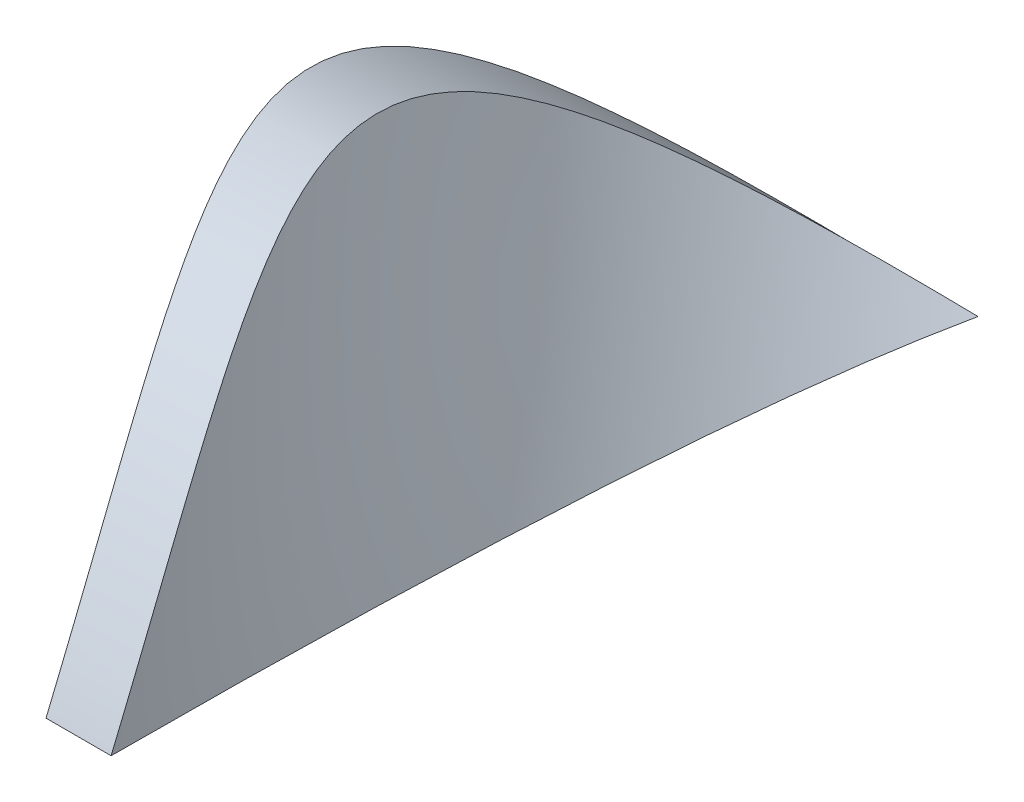
ISO-10303-21;
HEADER;
FILE_DESCRIPTION(('STEP AP214'),'2;1');
FILE_NAME('part.step','',(''),(''),'','','');
FILE_SCHEMA(('AUTOMOTIVE_DESIGN { 1 0 10303 214 1 1 1 1 }'));
ENDSEC;
DATA;
#1=APPLICATION_CONTEXT('core data for automotive mechanical design processes');
#2=APPLICATION_PROTOCOL_DEFINITION('international standard','automotive_design',2000,#1);
#3=PRODUCT_CONTEXT('',#1,'mechanical');
#4=PRODUCT('Part','Part','',(#3));
#5=PRODUCT_RELATED_PRODUCT_CATEGORY('part','',(#4));
#6=PRODUCT_DEFINITION_FORMATION('','',#4);
#7=PRODUCT_DEFINITION_CONTEXT('part definition',#1,'design');
#8=PRODUCT_DEFINITION('design','',#6,#7);
#9=PRODUCT_DEFINITION_SHAPE('','',#8);
#10=(LENGTH_UNIT() NAMED_UNIT(*) SI_UNIT(.MILLI.,.METRE.));
#11=(NAMED_UNIT(*) PLANE_ANGLE_UNIT() SI_UNIT($,.RADIAN.));
#12=(NAMED_UNIT(*) SI_UNIT($,.STERADIAN.) SOLID_ANGLE_UNIT());
#13=UNCERTAINTY_MEASURE_WITH_UNIT(LENGTH_MEASURE(1.E-05),#10,'distance_accuracy_value','');
#14=(GEOMETRIC_REPRESENTATION_CONTEXT(3) GLOBAL_UNCERTAINTY_ASSIGNED_CONTEXT((#13)) GLOBAL_UNIT_ASSIGNED_CONTEXT((#10,
#11,#12)) REPRESENTATION_CONTEXT('',''));
#15=CARTESIAN_POINT('',(0.,0.,0.));
#16=DIRECTION('',(0.,0.,1.));
#17=DIRECTION('',(1.,0.,0.));
#18=AXIS2_PLACEMENT_3D('',#15,#16,#17);
#19=CARTESIAN_POINT('',(0.499999999999999,23.,0.));
#20=CARTESIAN_POINT('',(-0.947037346833945,23.0314573336268,-3.3));
#21=CARTESIAN_POINT('',(-2.38660702132176,22.8813047470151,-6.6));
#22=CARTESIAN_POINT('',(-3.82617669580957,22.7311521604035,-9.9));
#23=CARTESIAN_POINT('',(-5.23557582422734,22.4017576495409,-13.2));
#24=CARTESIAN_POINT('',(-6.64497495264512,22.0723631386784,-16.5));
#25=CARTESIAN_POINT('',(-8.00197646880347,21.5689214517721,-19.8));
#26=CARTESIAN_POINT('',(-9.35897798496182,21.0654797648658,-23.1));
#27=CARTESIAN_POINT('',(-10.6421811643175,20.3959304780597,-26.4));
#28=CARTESIAN_POINT('',(-11.9253843436732,19.7263811912536,-29.7));
#29=CARTESIAN_POINT('',(-13.1145523055394,18.90128349677,-33.));
#30=CARTESIAN_POINT('',(-14.3037202674056,18.0761858022864,-36.3));
#31=CARTESIAN_POINT('',(-15.3800991226491,17.1085519836568,-39.6));
#32=CARTESIAN_POINT('',(-16.4564779778927,16.1409181650272,-42.9));
#33=CARTESIAN_POINT('',(-17.4030925889688,15.0460083856078,-46.2));
#34=CARTESIAN_POINT('',(-18.3497072000449,13.9510986061883,-49.5));
#35=CARTESIAN_POINT('',(-19.1516288890568,12.7461802472679,-52.8));
#36=CARTESIAN_POINT('',(-19.9535505780688,11.5412618883475,-56.1));
#37=CARTESIAN_POINT('',(-20.5981325609359,10.2453372322297,-59.4));
#38=CARTESIAN_POINT('',(-20.6567025293386,10.1275829850144,-59.6998546358201));
#39=CARTESIAN_POINT('',(-20.7139223718636,10.0091667971119,-59.9999053616932));
#40=CARTESIAN_POINT('',(0.499999999999999,-23.,0.));
#41=CARTESIAN_POINT('',(1.94703734683394,-22.9685426663732,-3.3));
#42=CARTESIAN_POINT('',(3.37872172263624,-22.7559715134508,-6.6));
#43=CARTESIAN_POINT('',(4.81040609843853,-22.5434003605285,-9.9));
#44=CARTESIAN_POINT('',(6.20415898535598,-22.1530677623761,-13.2));
#45=CARTESIAN_POINT('',(7.59791187227342,-21.7627351642237,-16.5));
#46=CARTESIAN_POINT('',(8.93175295469172,-21.2007968990874,-19.8));
#47=CARTESIAN_POINT('',(10.26559403711,-20.6388586339512,-23.1));
#48=CARTESIAN_POINT('',(11.5184878443614,-19.914176803958,-26.4));
#49=CARTESIAN_POINT('',(12.7713816516128,-19.1894949739648,-29.7));
#50=CARTESIAN_POINT('',(13.9235692999144,-18.3134982444776,-33.));
#51=CARTESIAN_POINT('',(15.075756948216,-17.4375015149903,-36.3));
#52=CARTESIAN_POINT('',(16.1090677500705,-16.4240048777281,-39.6));
#53=CARTESIAN_POINT('',(17.1423785519251,-15.4105082404659,-42.9));
#54=CARTESIAN_POINT('',(18.0405165787175,-14.275495142832,-46.2));
#55=CARTESIAN_POINT('',(18.9386546055099,-13.140482045198,-49.5));
#56=CARTESIAN_POINT('',(19.6874556840358,-11.9018523217659,-52.8));
#57=CARTESIAN_POINT('',(20.4362567625618,-10.6632225983338,-56.1));
#58=CARTESIAN_POINT('',(21.023911852501,-9.34051017976366,-59.4));
#59=CARTESIAN_POINT('',(21.0773091564348,-9.22032186141061,-59.6998546358201));
#60=CARTESIAN_POINT('',(21.1293288435644,-9.09953090112438,-59.9999053616932));
#61=(BOUNDED_SURFACE() B_SPLINE_SURFACE(1,2,((#19,#20,#21,#22,#23,#24,#25,#26,#27,#28,#29,#30,
#31,#32,#33,#34,#35,#36,#37,#38,#39),(#40,#41,#42,#43,#44,#45,#46,#47,#48,#49,#50,#51,#52,#53,
#54,#55,#56,#57,#58,#59,#60)),.UNSPECIFIED.,.F.,.F.,.F.) B_SPLINE_SURFACE_WITH_KNOTS((2,2),(3,2,
2,2,2,2,2,2,2,2,3),(0.,1.),(0.,0.02,0.04,0.06,0.08,0.1,0.12,0.14,0.16,0.18,0.1818205668658),
.UNSPECIFIED.) GEOMETRIC_REPRESENTATION_ITEM() RATIONAL_B_SPLINE_SURFACE(((1.,0.998026728428272,
1.,0.998026728428272,1.,0.998026728428272,1.,0.998026728428272,1.,0.998026728428272,1.,
0.998026728428272,1.,0.998026728428272,1.,0.998026728428272,1.,0.998026728428272,1.,
0.999820376357964,0.999673454401029),(1.,0.998026728428272,1.,0.998026728428272,1.,
0.998026728428272,1.,0.998026728428272,1.,0.998026728428272,1.,0.998026728428272,1.,
0.998026728428272,1.,0.998026728428272,1.,0.998026728428272,1.,0.999820376357964,0.999673454401029))) REPRESENTATION_ITEM('') SURFACE());
#62=CARTESIAN_POINT('',(0.5,0.,0.));
#63=CARTESIAN_POINT('',(0.499993963756887,0.504262825471586,-0.21010489328733));
#64=CARTESIAN_POINT('',(0.49395230338501,1.00604771893448,-0.426328946497115));
#65=CARTESIAN_POINT('',(0.468822817184543,2.00600349213839,-0.873220968579476));
#66=CARTESIAN_POINT('',(0.449665855202141,2.50414101147899,-1.10395956731846));
#67=CARTESIAN_POINT('',(0.397234944678944,3.49419743120691,-1.5805690008508));
#68=CARTESIAN_POINT('',(0.36392005300201,3.98609400090444,-1.82648194107646));
#69=CARTESIAN_POINT('',(0.282171686208607,4.96097567926543,-2.33420276614666));
#70=CARTESIAN_POINT('',(0.233723579700418,5.44395168248581,-2.59602583536442));
#71=CARTESIAN_POINT('',(0.119822484542874,6.40656113051524,-3.14107628937423));
#72=CARTESIAN_POINT('',(0.0540964891083761,6.88600083176323,-3.42459018763323));
#73=CARTESIAN_POINT('',(-0.0947921046354543,7.82997804517831,-4.00988421750113));
#74=CARTESIAN_POINT('',(-0.177931560782213,8.29453440162921,-4.31163973145813));
#75=CARTESIAN_POINT('',(-0.362359906475486,9.20581473497555,-4.93448404722974));
#76=CARTESIAN_POINT('',(-0.463621908539058,9.65256394681711,-5.25554374609105));
#77=CARTESIAN_POINT('',(-0.684909019047253,10.5252249569437,-5.91818683885571));
#78=CARTESIAN_POINT('',(-0.804919155927033,10.9511530289322,-6.25975372362376));
#79=CARTESIAN_POINT('',(-1.06712781413618,11.789083817036,-6.97328626218095));
#80=CARTESIAN_POINT('',(-1.20980480863857,12.2004748667174,-7.34579739228469));
#81=CARTESIAN_POINT('',(-1.51465047535699,12.9933440140858,-8.11413819086627));
#82=CARTESIAN_POINT('',(-1.67682062261378,13.374819844484,-8.50996962282704));
#83=CARTESIAN_POINT('',(-2.01874793479687,14.1010736067848,-9.32275589650397));
#84=CARTESIAN_POINT('',(-2.19840509434819,14.4460390998411,-9.73958472664272));
#85=CARTESIAN_POINT('',(-2.57428164933011,15.0969238892646,-10.5957798370251));
#86=CARTESIAN_POINT('',(-2.77050031178415,15.4028449121525,-11.0351451195166));
#87=CARTESIAN_POINT('',(-3.11034775233001,15.8782187822229,-11.7877796643048));
#88=CARTESIAN_POINT('',(-3.25018325247169,16.0595775816519,-12.0952829016317));
#89=CARTESIAN_POINT('',(-3.46387858630279,16.3160016600926,-12.5632794655109));
#90=CARTESIAN_POINT('',(-3.53577356235316,16.3988802842808,-12.7204153759525));
#91=CARTESIAN_POINT('',(-3.68074784020695,16.5593050762941,-13.0368477305281));
#92=CARTESIAN_POINT('',(-3.75382715527301,16.6368511843527,-13.1961441988536));
#93=CARTESIAN_POINT('',(-3.97452410076391,16.8613208853267,-13.6771642434026));
#94=CARTESIAN_POINT('',(-4.12361945053377,17.0000982585591,-14.0020592755028));
#95=CARTESIAN_POINT('',(-4.42452653379895,17.2552458522911,-14.6597549410534));
#96=CARTESIAN_POINT('',(-4.57634103665437,17.3715916204084,-14.9925637623923));
#97=CARTESIAN_POINT('',(-4.88111797103264,17.5811901855517,-15.6648858087254));
#98=CARTESIAN_POINT('',(-5.03408042139646,17.6744426026946,-16.004399143909));
#99=CARTESIAN_POINT('',(-5.33962377654512,17.8375925792834,-16.689078458535));
#100=CARTESIAN_POINT('',(-5.49220471821946,17.9074924908791,-17.0342438650042));
#101=CARTESIAN_POINT('',(-5.85084094000499,18.0452022467861,-17.8561248940497));
#102=CARTESIAN_POINT('',(-6.05611079303667,18.1029588590344,-18.3349216597571));
#103=CARTESIAN_POINT('',(-6.35849318465651,18.1575867173782,-19.0576242402661));
#104=CARTESIAN_POINT('',(-6.45837419720678,18.1704612585806,-19.2992946235913));
#105=CARTESIAN_POINT('',(-6.65586270965114,18.1857390305028,-19.7838925586852));
#106=CARTESIAN_POINT('',(-6.75347024222192,18.1881424118171,-20.0268200923235));
#107=CARTESIAN_POINT('',(-7.04194633917778,18.179936683988,-20.7570753868075));
#108=CARTESIAN_POINT('',(-7.22852663101314,18.1539218848288,-21.2460137375874));
#109=CARTESIAN_POINT('',(-7.58683374527203,18.0628906922451,-22.2256021801932));
#110=CARTESIAN_POINT('',(-7.75855986832986,17.9978724635992,-22.716252351485));
#111=CARTESIAN_POINT('',(-8.08953729329935,17.8286135663775,-23.713520056779));
#112=CARTESIAN_POINT('',(-8.24819061415992,17.7231503861839,-24.2201306765066));
#113=CARTESIAN_POINT('',(-8.4696738252755,17.5381592557801,-24.9781650667816));
#114=CARTESIAN_POINT('',(-8.54075822736242,17.4720217296937,-25.2305541253464));
#115=CARTESIAN_POINT('',(-8.67714005935553,17.3312154894282,-25.734530673967));
#116=CARTESIAN_POINT('',(-8.74243748807443,17.2565467734988,-25.9861181638585));
#117=CARTESIAN_POINT('',(-8.86691909256832,17.0990772862291,-26.4883250669947));
#118=CARTESIAN_POINT('',(-8.92610181644819,17.0162745925942,-26.7389442367825));
#119=CARTESIAN_POINT('',(-9.03788665233517,16.8429689351689,-27.2389711201983));
#120=CARTESIAN_POINT('',(-9.09048880718639,16.7524660215188,-27.4883788417036));
#121=CARTESIAN_POINT('',(-9.23811131109021,16.4700477356331,-28.2344732925923));
#122=CARTESIAN_POINT('',(-9.32296451645707,16.2672015014643,-28.7290986784179));
#123=CARTESIAN_POINT('',(-9.47149838975158,15.8123906916321,-29.7645941568945));
#124=CARTESIAN_POINT('',(-9.53187631135914,15.5574838863754,-30.3046487313661));
#125=CARTESIAN_POINT('',(-9.59467831203142,15.1550138092617,-31.1066725811272));
#126=CARTESIAN_POINT('',(-9.61098519254075,15.0174834461412,-31.3727099630094));
#127=CARTESIAN_POINT('',(-9.63419364393446,14.7362725909077,-31.9019231081801));
#128=CARTESIAN_POINT('',(-9.64109585992391,14.5925925213261,-32.1650990665168));
#129=CARTESIAN_POINT('',(-9.64542400378624,14.2996128182672,-32.688448826512));
#130=CARTESIAN_POINT('',(-9.64284807047407,14.1503120867814,-32.9486220284689));
#131=CARTESIAN_POINT('',(-9.62793836595041,13.8466795162773,-33.4657139364113));
#132=CARTESIAN_POINT('',(-9.6156046825943,13.692347722569,-33.7226326716776));
#133=CARTESIAN_POINT('',(-9.5638728029722,13.222621302303,-34.4882373802149));
#134=CARTESIAN_POINT('',(-9.50974459051253,12.9004456599846,-34.9918605933988));
#135=CARTESIAN_POINT('',(-9.35531158586605,12.2106367225511,-36.0318809105356));
#136=CARTESIAN_POINT('',(-9.25106115202734,11.8416139864388,-36.5667622476924));
#137=CARTESIAN_POINT('',(-8.99649499136807,11.0920576842403,-37.6172362519253));
#138=CARTESIAN_POINT('',(-8.84617597864086,10.7115232988149,-38.1328275401668));
#139=CARTESIAN_POINT('',(-8.58737188487011,10.1356056515774,-38.8909071271268));
#140=CARTESIAN_POINT('',(-8.4955190075606,9.94272535151483,-39.1411174454271));
#141=CARTESIAN_POINT('',(-8.30093173479692,9.55578115368505,-39.6363384400505));
#142=CARTESIAN_POINT('',(-8.19819729871862,9.36171725150162,-39.8813490969575));
#143=CARTESIAN_POINT('',(-7.87388591799082,8.77852779657669,-40.6084307162196));
#144=CARTESIAN_POINT('',(-7.63618318926565,8.38836501979199,-41.0826030496962));
#145=CARTESIAN_POINT('',(-7.20074372376992,7.73004521898825,-41.8653749478295));
#146=CARTESIAN_POINT('',(-7.01350515495667,7.46161062931615,-42.179681002679));
#147=CARTESIAN_POINT('',(-6.62087815998593,6.92613162846886,-42.7980470650016));
#148=CARTESIAN_POINT('',(-6.41548840254478,6.65908732078631,-43.1021063186686));
#149=CARTESIAN_POINT('',(-5.98750313871658,6.12721452168681,-43.7000656295465));
#150=CARTESIAN_POINT('',(-5.7649025074311,5.86238671649795,-43.9939626227361));
#151=CARTESIAN_POINT('',(-5.30353791392991,5.3357482511433,-44.5716255204894));
#152=CARTESIAN_POINT('',(-5.06477218852269,5.07393792376233,-44.8553903147209));
#153=CARTESIAN_POINT('',(-4.32519928629331,4.29343964650413,-45.6923032415492));
#154=CARTESIAN_POINT('',(-3.80152705270985,3.78019262398994,-46.2305018956784));
#155=CARTESIAN_POINT('',(-2.70136842877065,2.77252853093403,-47.2682084018451));
#156=CARTESIAN_POINT('',(-2.12490057129549,2.27810493841689,-47.7677297180454));
#157=CARTESIAN_POINT('',(-1.1442671106159,1.48590870975757,-48.5557059314985));
#158=CARTESIAN_POINT('',(-0.753604292007125,1.18195944232497,-48.8549023727487));
#159=CARTESIAN_POINT('',(-0.15586009645515,0.733140964805754,-49.2926587734125));
#160=CARTESIAN_POINT('',(0.0449453770413828,0.584999630804235,-49.4364694639433));
#161=CARTESIAN_POINT('',(0.450533578028994,0.29087249671272,-49.7207354295742));
#162=CARTESIAN_POINT('',(0.655316899232292,0.144887024208397,-49.8611901967014));
#163=CARTESIAN_POINT('',(0.861976980592275,0.,-50.));
#164=B_SPLINE_CURVE_WITH_KNOTS('',3,(#62,#63,#64,#65,#66,#67,#68,#69,#70,#71,#72,#73,#74,#75,
#76,#77,#78,#79,#80,#81,#82,#83,#84,#85,#86,#87,#88,#89,#90,#91,#92,#93,#94,#95,#96,#97,#98,#99,
#100,#101,#102,#103,#104,#105,#106,#107,#108,#109,#110,#111,#112,#113,#114,#115,#116,#117,#118,
#119,#120,#121,#122,#123,#124,#125,#126,#127,#128,#129,#130,#131,#132,#133,#134,#135,#136,#137,
#138,#139,#140,#141,#142,#143,#144,#145,#146,#147,#148,#149,#150,#151,#152,#153,#154,#155,#156,
#157,#158,#159,#160,#161,#162,#163),.UNSPECIFIED.,.F.,.F.,(4,2,2,2,2,2,2,2,2,2,2,2,2,2,2,2,2,2,
2,2,2,2,2,2,2,2,2,2,2,2,2,2,2,2,2,2,2,2,2,2,2,2,2,2,2,2,2,2,2,2,4),(0.,1.63887433988277,
3.28645506228483,4.93883317711872,6.5928138475587,8.27468884355105,9.95434268286718,
11.6315248596179,13.3073744834731,15.0249930732367,16.7427417165764,18.4511872871231,
20.1595572851458,21.3090940022518,21.8839586250077,22.4588296897582,23.6084215279212,
24.7592595214831,25.9101164449498,27.0608574149226,28.6311407023486,29.4164000803085,
30.2016481647748,31.771695615651,33.3418169474924,34.9637062559073,35.7748091047095,
36.5859121199198,37.397207285552,38.2084971688107,39.8308595863855,41.6295192479119,
42.529117622993,43.4286542877703,44.3283676002747,45.2280728121665,47.0271784939081,
48.9995785782622,50.972119379601,51.9589460871278,52.9457764789036,54.9192354466612,
56.2801072337381,57.6410789157808,59.0024574280978,60.3639846713943,63.0896284273677,
65.8143190395564,67.5489749285445,68.4129566721083,69.2770683751739),.UNSPECIFIED.);
#165=CARTESIAN_POINT('',(0.499999999999973,0.,0.));
#166=VERTEX_POINT('',#165);
#167=CARTESIAN_POINT('',(0.861976980592274,0.,-50.));
#168=VERTEX_POINT('',#167);
#169=EDGE_CURVE('E53',#166,#168,#164,.T.);
#170=CARTESIAN_POINT('',(1.20364037168911,0.,-59.9999053616932));
#171=CARTESIAN_POINT('',(1.17954823951594,0.,-59.5201220126039));
#172=CARTESIAN_POINT('',(1.15702526069088,0.,-59.0402628205059));
#173=CARTESIAN_POINT('',(1.11465908100289,0.,-58.0804303787989));
#174=CARTESIAN_POINT('',(1.09481585420651,0.,-57.6004571303387));
#175=CARTESIAN_POINT('',(1.05735208687219,0.,-56.6404732337168));
#176=CARTESIAN_POINT('',(1.03973132280394,0.,-56.1604625941829));
#177=CARTESIAN_POINT('',(1.00636995486502,0.,-55.2003750335958));
#178=CARTESIAN_POINT('',(0.990629356332259,0.,-54.7202981123583));
#179=CARTESIAN_POINT('',(0.945788275327831,0.,-53.2800246398038));
#180=CARTESIAN_POINT('',(0.919067317508941,0.,-52.3197538583361));
#181=CARTESIAN_POINT('',(0.870500327065905,0.,-50.3990939757706));
#182=CARTESIAN_POINT('',(0.848654286375199,0.,-49.4387048748712));
#183=CARTESIAN_POINT('',(0.80861742671974,0.,-47.5179437445854));
#184=CARTESIAN_POINT('',(0.790426256682731,0.,-46.557571722428));
#185=CARTESIAN_POINT('',(0.757000190490842,0.,-44.6367611452742));
#186=CARTESIAN_POINT('',(0.741765342880637,0.,-43.6763225894442));
#187=CARTESIAN_POINT('',(0.713633300312523,0.,-41.7554014785568));
#188=CARTESIAN_POINT('',(0.700736130154276,0.,-40.7949189231408));
#189=CARTESIAN_POINT('',(0.676859675352567,0.,-38.8739294610616));
#190=CARTESIAN_POINT('',(0.665880392186055,0.,-37.9134225543802));
#191=CARTESIAN_POINT('',(0.644837064283918,0.,-35.9265046158616));
#192=CARTESIAN_POINT('',(0.634887462480717,0.,-34.9000923827256));
#193=CARTESIAN_POINT('',(0.616489936385046,0.,-32.847262411253));
#194=CARTESIAN_POINT('',(0.608042000662192,0.,-31.8208446730179));
#195=CARTESIAN_POINT('',(0.592457286899612,0.,-29.7680013271449));
#196=CARTESIAN_POINT('',(0.585320506298953,0.,-28.7415757195265));
#197=CARTESIAN_POINT('',(0.572137675689942,0.,-26.6886880523581));
#198=CARTESIAN_POINT('',(0.566091657044515,0.,-25.6622259926086));
#199=CARTESIAN_POINT('',(0.554986191926722,0.,-23.6092944674861));
#200=CARTESIAN_POINT('',(0.549926747474082,0.,-22.5828250021024));
#201=CARTESIAN_POINT('',(0.540654170697794,0.,-20.5298816638032));
#202=CARTESIAN_POINT('',(0.536441038888356,0.,-19.5034077908853));
#203=CARTESIAN_POINT('',(0.526882748041908,0.,-16.9371658709381));
#204=CARTESIAN_POINT('',(0.522025019223187,0.,-15.3973960016187));
#205=CARTESIAN_POINT('',(0.513825415794552,0.,-12.317852225115));
#206=CARTESIAN_POINT('',(0.510483541266041,0.,-10.7780783179304));
#207=CARTESIAN_POINT('',(0.506072094698084,0.,-8.21182646310648));
#208=CARTESIAN_POINT('',(0.504616406739098,0.,-7.18534915951444));
#209=CARTESIAN_POINT('',(0.50229764498695,0.,-5.13239360964267));
#210=CARTESIAN_POINT('',(0.501434571350532,0.,-4.10591536336275));
#211=CARTESIAN_POINT('',(0.50028693146188,0.,-2.05295807443093));
#212=CARTESIAN_POINT('',(0.500002365475461,0.,-1.02647903177887));
#213=CARTESIAN_POINT('',(0.499999999999999,0.,0.));
#214=B_SPLINE_CURVE_WITH_KNOTS('',3,(#170,#171,#172,#173,#174,#175,#176,#177,#178,#179,#180,
#181,#182,#183,#184,#185,#186,#187,#188,#189,#190,#191,#192,#193,#194,#195,#196,#197,#198,#199,
#200,#201,#202,#203,#204,#205,#206,#207,#208,#209,#210,#211,#212,#213),.UNSPECIFIED.,.F.,.F.,(4,
2,2,2,2,2,2,2,2,2,2,2,2,2,2,2,2,2,2,2,2,4),(0.,1.44115673184092,2.88229951581123,4.323297237103,
5.76429904937937,8.64620804474785,11.5281122713661,14.4097395413042,17.2914141253725,
20.1731192784029,23.0548266506001,26.1342066635489,29.2135632358639,32.2929137935524,
35.3723528784005,38.4517982674496,41.5312455275318,46.1505771993538,50.7699091192418,
53.84934396481,56.9287796248767,60.0082166998958),.UNSPECIFIED.);
#215=EDGE_CURVE('E60',#168,#166,#214,.T.);
#216=ORIENTED_EDGE('',*,*,#169,.T.);
#217=ORIENTED_EDGE('',*,*,#215,.T.);
#218=EDGE_LOOP('',(#216,#217));
#219=FACE_BOUND('',#218,.T.);
#220=ADVANCED_FACE('F38',(#219),#61,.F.);
#221=CARTESIAN_POINT('',(4.5,-23.,0.));
#222=CARTESIAN_POINT('',(5.94703734683394,-22.7168839973586,-3.3));
#223=CARTESIAN_POINT('',(7.34718052789415,-22.2546385791936,-6.6));
#224=CARTESIAN_POINT('',(8.74732370895435,-21.7923931610287,-9.9));
#225=CARTESIAN_POINT('',(10.0784916298705,-21.1583082137167,-13.2));
#226=CARTESIAN_POINT('',(11.4096595507866,-20.5242232664047,-16.5));
#227=CARTESIAN_POINT('',(12.6508588982447,-19.7282986883487,-19.8));
#228=CARTESIAN_POINT('',(13.8920582457028,-18.9323741102928,-23.1));
#229=CARTESIAN_POINT('',(15.0237145645368,-17.9871621075511,-26.4));
#230=CARTESIAN_POINT('',(16.1553708833709,-17.0419501048095,-29.7));
#231=CARTESIAN_POINT('',(17.1596372774141,-15.9623572353077,-33.));
#232=CARTESIAN_POINT('',(18.1639036714574,-14.8827643658058,-36.3));
#233=CARTESIAN_POINT('',(19.0249422597562,-13.6858164540134,-39.6));
#234=CARTESIAN_POINT('',(19.885980848055,-12.4888685422209,-42.9));
#235=CARTESIAN_POINT('',(20.5902125377123,-11.1934421717288,-46.2));
#236=CARTESIAN_POINT('',(21.2944442273695,-9.89801580123672,-49.5));
#237=CARTESIAN_POINT('',(21.8307628639518,-8.52454061975786,-52.8));
#238=CARTESIAN_POINT('',(22.3670815005341,-7.15106543827899,-56.1));
#239=CARTESIAN_POINT('',(22.7270290187613,-5.72120196989958,-59.4));
#240=CARTESIAN_POINT('',(22.7597355002319,-5.59127802080737,-59.6998531268795));
#241=CARTESIAN_POINT('',(22.7909544161741,-5.46098862843296,-59.9999023419371));
#242=CARTESIAN_POINT('',(4.5,23.,0.));
#243=CARTESIAN_POINT('',(3.05296265316606,23.2831160026414,-3.3));
#244=CARTESIAN_POINT('',(1.58185178393615,23.3826376812724,-6.6));
#245=CARTESIAN_POINT('',(0.110740914706251,23.4821593599033,-9.9));
#246=CARTESIAN_POINT('',(-1.36124317971282,23.3965171982004,-13.2));
#247=CARTESIAN_POINT('',(-2.83322727413189,23.3108750364974,-16.5));
#248=CARTESIAN_POINT('',(-4.28287052525046,23.0414196625108,-19.8));
#249=CARTESIAN_POINT('',(-5.73251377636903,22.7719642885242,-23.1));
#250=CARTESIAN_POINT('',(-7.13695444414207,22.3229451744666,-26.4));
#251=CARTESIAN_POINT('',(-8.5413951119151,21.8739260604089,-29.7));
#252=CARTESIAN_POINT('',(-9.87848432803962,21.2524245059399,-33.));
#253=CARTESIAN_POINT('',(-11.2155735441641,20.6309229514709,-36.3));
#254=CARTESIAN_POINT('',(-12.4642246129635,19.8467404073716,-39.6));
#255=CARTESIAN_POINT('',(-13.7128756817628,19.0625578632722,-42.9));
#256=CARTESIAN_POINT('',(-14.853396629974,18.1280613567109,-46.2));
#257=CARTESIAN_POINT('',(-15.9939175781853,17.1935648501496,-49.5));
#258=CARTESIAN_POINT('',(-17.0083217091409,16.123491949276,-52.8));
#259=CARTESIAN_POINT('',(-18.0227258400965,15.0534190484024,-56.1));
#260=CARTESIAN_POINT('',(-18.8950153946756,13.8646454420938,-59.4));
#261=CARTESIAN_POINT('',(-18.9742756220953,13.7566280230018,-59.6998531268795));
#262=CARTESIAN_POINT('',(-19.0522956998506,13.6477114772204,-59.9999023419371));
#263=(BOUNDED_SURFACE() B_SPLINE_SURFACE(1,2,((#221,#222,#223,#224,#225,#226,#227,#228,#229,
#230,#231,#232,#233,#234,#235,#236,#237,#238,#239,#240,#241),(#242,#243,#244,#245,#246,#247,
#248,#249,#250,#251,#252,#253,#254,#255,#256,#257,#258,#259,#260,#261,#262)),.UNSPECIFIED.,.F.,
.F.,.F.) B_SPLINE_SURFACE_WITH_KNOTS((2,2),(3,2,2,2,2,2,2,2,2,2,3),(0.,1.),(0.,0.02,0.04,0.06,
0.08,0.1,0.12,0.14,0.16,0.18,0.181820557705916),
.UNSPECIFIED.) GEOMETRIC_REPRESENTATION_ITEM() RATIONAL_B_SPLINE_SURFACE(((1.,0.998026728428272,
1.,0.998026728428272,1.,0.998026728428272,1.,0.998026728428272,1.,0.998026728428272,1.,
0.998026728428272,1.,0.998026728428272,1.,0.998026728428272,1.,0.998026728428272,1.,
0.999820377261711,0.999673455879457),(1.,0.998026728428272,1.,0.998026728428272,1.,
0.998026728428272,1.,0.998026728428272,1.,0.998026728428272,1.,0.998026728428272,1.,
0.998026728428272,1.,0.998026728428272,1.,0.998026728428272,1.,0.999820377261711,0.999673455879457))) REPRESENTATION_ITEM('') SURFACE());
#264=CARTESIAN_POINT('',(7.7577928253305,0.,-50.));
#265=CARTESIAN_POINT('',(7.35572537689656,0.250838679910948,-49.7596704482108));
#266=CARTESIAN_POINT('',(6.95895963356265,0.505274516369599,-49.5141388045571));
#267=CARTESIAN_POINT('',(6.17623222747603,1.02190330198413,-49.0114975410599));
#268=CARTESIAN_POINT('',(5.79029922422565,1.28411363061732,-48.754361185429));
#269=CARTESIAN_POINT('',(5.03091579711837,1.81597629408946,-48.2281609481255));
#270=CARTESIAN_POINT('',(4.65748218941744,2.08563782859776,-47.9590820481927));
#271=CARTESIAN_POINT('',(3.92477964012185,2.63200884055132,-47.4086226237695));
#272=CARTESIAN_POINT('',(3.56551645806982,2.90872111005176,-47.127237193334));
#273=CARTESIAN_POINT('',(2.85905327738637,3.47173842704598,-46.548682689838));
#274=CARTESIAN_POINT('',(2.51201884964423,3.75811355547464,-46.2513792650454));
#275=CARTESIAN_POINT('',(1.83578273506724,4.33704635208722,-45.6433572253086));
#276=CARTESIAN_POINT('',(1.50657061086147,4.62960025909049,-45.3326466579405));
#277=CARTESIAN_POINT('',(0.867576601381368,5.22023347124785,-44.6973504076641));
#278=CARTESIAN_POINT('',(0.55778282571128,5.51830924742184,-44.3727734244231));
#279=CARTESIAN_POINT('',(-0.0408023315600326,6.11924722432775,-43.7092198576395));
#280=CARTESIAN_POINT('',(-0.329599877183952,6.42210798825027,-43.3702475469148));
#281=CARTESIAN_POINT('',(-0.861202935111297,7.00602428527084,-42.7065742117917));
#282=CARTESIAN_POINT('',(-1.10583397082567,7.28677387600531,-42.3830670630123));
#283=CARTESIAN_POINT('',(-1.57470011076999,7.85048040445616,-41.7233861813823));
#284=CARTESIAN_POINT('',(-1.79893455778754,8.13343741298052,-41.387212040873));
#285=CARTESIAN_POINT('',(-2.2256218407255,8.70035900603023,-40.7020899225829));
#286=CARTESIAN_POINT('',(-2.42807426580288,8.9843236094561,-40.3531417040291));
#287=CARTESIAN_POINT('',(-2.80916107672106,9.55084813470522,-39.6437237785159));
#288=CARTESIAN_POINT('',(-2.98787710160771,9.83340947434152,-39.2832991431633));
#289=CARTESIAN_POINT('',(-3.32134494162354,10.3964785042694,-38.5499403175989));
#290=CARTESIAN_POINT('',(-3.4760962588187,10.6769861517743,-38.1770058676566));
#291=CARTESIAN_POINT('',(-3.7605463012196,11.2341316219444,-37.4188677973705));
#292=CARTESIAN_POINT('',(-3.89024514164312,11.5107694624014,-37.0336642334626));
#293=CARTESIAN_POINT('',(-4.12485371053124,12.0608545037179,-36.2474989329673));
#294=CARTESIAN_POINT('',(-4.22950527551463,12.3342429914578,-35.8464189325355));
#295=CARTESIAN_POINT('',(-4.41161635987959,12.8727493470844,-35.032606359227));
#296=CARTESIAN_POINT('',(-4.48907484878218,13.137866901198,-34.6198733454008));
#297=CARTESIAN_POINT('',(-4.58450713575231,13.527424511493,-33.9926306530324));
#298=CARTESIAN_POINT('',(-4.6128604367244,13.6559362524617,-33.7821713151653));
#299=CARTESIAN_POINT('',(-4.6625973561933,13.9099409090492,-33.3586128288534));
#300=CARTESIAN_POINT('',(-4.68398097010551,14.0354338226822,-33.1455136786722));
#301=CARTESIAN_POINT('',(-4.71986191809895,14.2831298802276,-32.7166716340861));
#302=CARTESIAN_POINT('',(-4.73435525124251,14.405331074006,-32.5009272780995));
#303=CARTESIAN_POINT('',(-4.75649855817503,14.646021797884,-32.0670392267707));
#304=CARTESIAN_POINT('',(-4.76414850666591,14.7645113142612,-31.8488955225618));
#305=CARTESIAN_POINT('',(-4.77685680981333,15.1138885515824,-31.1910479620907));
#306=CARTESIAN_POINT('',(-4.7716789851066,15.3387222978712,-30.7478633049918));
#307=CARTESIAN_POINT('',(-4.73451412974589,15.7692683355782,-29.8534940636242));
#308=CARTESIAN_POINT('',(-4.70253222735719,15.9749842763297,-29.4023110258001));
#309=CARTESIAN_POINT('',(-4.6281643773703,16.2971328922635,-28.6501959887943));
#310=CARTESIAN_POINT('',(-4.59318803729321,16.4198609267471,-28.3511967833425));
#311=CARTESIAN_POINT('',(-4.51244673825822,16.6550667478644,-27.7506476717125));
#312=CARTESIAN_POINT('',(-4.46668314073073,16.767545825509,-27.4490980920366));
#313=CARTESIAN_POINT('',(-4.39024778930361,16.9279621045257,-26.9951686998355));
#314=CARTESIAN_POINT('',(-4.36346896082775,16.9800536817568,-26.843581203764));
#315=CARTESIAN_POINT('',(-4.30736077458828,17.0813660289612,-26.5399309430439));
#316=CARTESIAN_POINT('',(-4.27803158248229,17.1305869850479,-26.3878682098818));
#317=CARTESIAN_POINT('',(-4.18640482550361,17.2738037880423,-25.9310111456695));
#318=CARTESIAN_POINT('',(-4.12046569951669,17.3633585426094,-25.625533921459));
#319=CARTESIAN_POINT('',(-3.97948569794218,17.5297343974998,-25.0135541689544));
#320=CARTESIAN_POINT('',(-3.90445359547705,17.6065676051214,-24.7070529020587));
#321=CARTESIAN_POINT('',(-3.74582646247542,17.7468467192245,-24.0931928788637));
#322=CARTESIAN_POINT('',(-3.66223137218733,17.8102925322808,-23.7858341165955));
#323=CARTESIAN_POINT('',(-3.48715139897031,17.9230623185023,-23.1708127882264));
#324=CARTESIAN_POINT('',(-3.39566748449748,17.9723880218929,-22.8631502639874));
#325=CARTESIAN_POINT('',(-3.20552769814016,18.0562520314263,-22.2480286782603));
#326=CARTESIAN_POINT('',(-3.10687207226266,18.0907908445155,-21.9405696101578));
#327=CARTESIAN_POINT('',(-2.91548023856984,18.1412324405242,-21.3635058143986));
#328=CARTESIAN_POINT('',(-2.82346741012972,18.1588817531418,-21.0938124805158));
#329=CARTESIAN_POINT('',(-2.63507840431992,18.1819156181516,-20.5554304011407));
#330=CARTESIAN_POINT('',(-2.53870234507274,18.1873005023672,-20.2867416286657));
#331=CARTESIAN_POINT('',(-2.34222174350293,18.185497972857,-19.7507925049954));
#332=CARTESIAN_POINT('',(-2.24211744742984,18.1783113880387,-19.4835320607879));
#333=CARTESIAN_POINT('',(-2.03897328924785,18.1511144615914,-18.9507814419716));
#334=CARTESIAN_POINT('',(-1.93593340957753,18.1311040432315,-18.6852912779649));
#335=CARTESIAN_POINT('',(-1.72758806024973,18.0780917228694,-18.1567019779099));
#336=CARTESIAN_POINT('',(-1.62228408378229,18.0450981490822,-17.8936014194868));
#337=CARTESIAN_POINT('',(-1.41001009150316,17.966013079293,-17.3700539888255));
#338=CARTESIAN_POINT('',(-1.30304007216387,17.9199215555546,-17.1096071222079));
#339=CARTESIAN_POINT('',(-1.08809984228025,17.8146181048523,-16.5918255607088));
#340=CARTESIAN_POINT('',(-0.98012974387806,17.7554076322941,-16.3344905241729));
#341=CARTESIAN_POINT('',(-0.76382967653905,17.6239289055661,-15.8233229168619));
#342=CARTESIAN_POINT('',(-0.655499674515465,17.5516594163045,-15.5694906798198));
#343=CARTESIAN_POINT('',(-0.351337792561056,17.3302887214877,-14.86133378941));
#344=CARTESIAN_POINT('',(-0.155810286784598,17.1664181593566,-14.4114024357351));
#345=CARTESIAN_POINT('',(0.230662987956496,16.7978324493251,-13.5267143661196));
#346=CARTESIAN_POINT('',(0.421609206743864,16.5931213299734,-13.0919561584523));
#347=CARTESIAN_POINT('',(0.795211007193932,16.1452784842297,-12.239473441011));
#348=CARTESIAN_POINT('',(0.97787255196054,15.9021749753217,-11.8217367023378));
#349=CARTESIAN_POINT('',(1.3324831199161,15.3803695213423,-11.0042986302761));
#350=CARTESIAN_POINT('',(1.50443080129532,15.1016631306269,-10.6045995576558));
#351=CARTESIAN_POINT('',(1.8074072585021,14.562209454982,-9.89051901233429));
#352=CARTESIAN_POINT('',(1.94042396536926,14.3064593351312,-9.57318195270555));
#353=CARTESIAN_POINT('',(2.1968641168003,13.7747573242383,-8.95171299409207));
#354=CARTESIAN_POINT('',(2.32028537023257,13.4988008468266,-8.64758411816698));
#355=CARTESIAN_POINT('',(2.55691320378859,12.9287683683772,-8.05263301944171));
#356=CARTESIAN_POINT('',(2.67011922307556,12.6346913739766,-7.76181152767506));
#357=CARTESIAN_POINT('',(2.8865808767801,12.0287292059861,-7.19175673351155));
#358=CARTESIAN_POINT('',(2.98977760852556,11.7167540075548,-6.91259695615961));
#359=CARTESIAN_POINT('',(3.18528734924226,11.0784200964377,-6.36731196956751));
#360=CARTESIAN_POINT('',(3.27760141581211,10.7520627856755,-6.10118549519738));
#361=CARTESIAN_POINT('',(3.45133034658539,10.0867248361163,-5.58154983262648));
#362=CARTESIAN_POINT('',(3.53274588897703,9.74774498446828,-5.32803985994932));
#363=CARTESIAN_POINT('',(3.7151862947538,8.92154177414987,-4.73457499095153));
#364=CARTESIAN_POINT('',(3.81111134214414,8.42903419151175,-4.40039186086542));
#365=CARTESIAN_POINT('',(3.98289367262667,7.42611919585795,-3.75409624618808));
#366=CARTESIAN_POINT('',(4.05874112390725,6.91570315127691,-3.44199462931717));
#367=CARTESIAN_POINT('',(4.1914052371779,5.88003850508255,-2.83822183465809));
#368=CARTESIAN_POINT('',(4.24820730338852,5.35477886052764,-2.54656646098457));
#369=CARTESIAN_POINT('',(4.34309362890009,4.30091418329599,-1.98684698835496));
#370=CARTESIAN_POINT('',(4.38145921523457,3.77249285762162,-1.71848315513206));
#371=CARTESIAN_POINT('',(4.44190160920822,2.70691502976636,-1.19908090242317));
#372=CARTESIAN_POINT('',(4.46399281246359,2.16976667810864,-0.948027349647601));
#373=CARTESIAN_POINT('',(4.49301927824335,1.08936263653466,-0.462285431807167));
#374=CARTESIAN_POINT('',(4.49999336020209,0.546126198883231,-0.227556651785474));
#375=CARTESIAN_POINT('',(4.5,0.,0.));
#376=B_SPLINE_CURVE_WITH_KNOTS('',3,(#264,#265,#266,#267,#268,#269,#270,#271,#272,#273,#274,
#275,#276,#277,#278,#279,#280,#281,#282,#283,#284,#285,#286,#287,#288,#289,#290,#291,#292,#293,
#294,#295,#296,#297,#298,#299,#300,#301,#302,#303,#304,#305,#306,#307,#308,#309,#310,#311,#312,
#313,#314,#315,#316,#317,#318,#319,#320,#321,#322,#323,#324,#325,#326,#327,#328,#329,#330,#331,
#332,#333,#334,#335,#336,#337,#338,#339,#340,#341,#342,#343,#344,#345,#346,#347,#348,#349,#350,
#351,#352,#353,#354,#355,#356,#357,#358,#359,#360,#361,#362,#363,#364,#365,#366,#367,#368,#369,
#370,#371,#372,#373,#374,#375),.UNSPECIFIED.,.F.,.F.,(4,2,2,2,2,2,2,2,2,2,2,2,2,2,2,2,2,2,2,2,2,
2,2,2,2,2,2,2,2,2,2,2,2,2,2,2,2,2,2,2,2,2,2,2,2,2,2,2,2,2,2,2,2,2,2,4),(0.,1.59405491235337,
3.19199122986067,4.79199734855228,6.39264722259529,8.010046632836,9.62648835589434,
11.2419304176187,12.8568962904605,14.3361719215125,15.8154952004423,17.2948463768351,
18.7689698859707,20.2431240200483,21.7172713742451,23.2060149151347,24.6948148657282,
25.439362320581,26.1839102651882,26.9288900154881,27.6738725197574,29.1636141916809,
30.6530709052117,31.6280430420619,32.6028921961525,33.0903820035971,33.5778401699973,
34.5527113298215,35.5266492888591,36.5005940443917,37.4744194052515,38.448211377302,
39.3044345798052,40.1606346162594,41.0167782007614,41.8729269080121,42.7285273203824,
43.5841295446045,44.439636961635,45.2952253329798,46.8448653785876,48.3943526418326,
49.9427063242632,51.4912535351373,52.7766364891027,54.0623121046914,55.3480582635496,
56.6409622236229,57.93374043301,59.2264381585725,61.0338519744565,62.8421492335507,
64.6518291636238,66.4329411993955,68.2124758424415,69.9874353569907),.UNSPECIFIED.);
#377=CARTESIAN_POINT('',(7.7577928253305,0.,-50.));
#378=VERTEX_POINT('',#377);
#379=CARTESIAN_POINT('',(4.49999999999998,0.,0.));
#380=VERTEX_POINT('',#379);
#381=EDGE_CURVE('E12',#378,#380,#376,.T.);
#382=CARTESIAN_POINT('',(4.5,0.,0.));
#383=CARTESIAN_POINT('',(4.50001160540337,0.,-0.766379212528268));
#384=CARTESIAN_POINT('',(4.50144268050788,0.,-1.53275859703333));
#385=CARTESIAN_POINT('',(4.50719201119356,0.,-3.06551445759427));
#386=CARTESIAN_POINT('',(4.51151029673035,0.,-3.83189093353747));
#387=CARTESIAN_POINT('',(4.52308231906268,0.,-5.36462552273375));
#388=CARTESIAN_POINT('',(4.53033607003687,0.,-6.13098363588026));
#389=CARTESIAN_POINT('',(4.54784118505342,0.,-7.66366576935979));
#390=CARTESIAN_POINT('',(4.5580925494101,0.,-8.42998978968924));
#391=CARTESIAN_POINT('',(4.58167096184867,0.,-9.96258815697192));
#392=CARTESIAN_POINT('',(4.5949979996762,0.,-10.7288625040822));
#393=CARTESIAN_POINT('',(4.62499799573554,0.,-12.2653650340852));
#394=CARTESIAN_POINT('',(4.64168813021937,0.,-13.0355928828635));
#395=CARTESIAN_POINT('',(4.67848329588559,0.,-14.5759676099247));
#396=CARTESIAN_POINT('',(4.69858832896498,0.,-15.3461144881624));
#397=CARTESIAN_POINT('',(4.7424225152434,0.,-16.8863104028801));
#398=CARTESIAN_POINT('',(4.76615169094867,0.,-17.6563594387229));
#399=CARTESIAN_POINT('',(4.81758511919534,0.,-19.1963378307052));
#400=CARTESIAN_POINT('',(4.84528943686987,0.,-19.9662671846767));
#401=CARTESIAN_POINT('',(4.90486605133331,0.,-21.5059897300748));
#402=CARTESIAN_POINT('',(4.93673848142352,0.,-22.2757829163577));
#403=CARTESIAN_POINT('',(5.00532661109145,0.,-23.8210493137817));
#404=CARTESIAN_POINT('',(5.04207746317607,0.,-24.5965209733939));
#405=CARTESIAN_POINT('',(5.12080116227416,0.,-26.1471899947312));
#406=CARTESIAN_POINT('',(5.16277394043195,0.,-26.922387359938));
#407=CARTESIAN_POINT('',(5.25230068863539,0.,-28.4724121905985));
#408=CARTESIAN_POINT('',(5.29985431145213,0.,-29.2472396760567));
#409=CARTESIAN_POINT('',(5.40129755135336,0.,-30.7964104703019));
#410=CARTESIAN_POINT('',(5.45518657085344,0.,-31.5707538178395));
#411=CARTESIAN_POINT('',(5.54140793326528,0.,-32.7306761902977));
#412=CARTESIAN_POINT('',(5.57099679275436,0.,-33.1164601228474));
#413=CARTESIAN_POINT('',(5.63203128573728,0.,-33.8878811212398));
#414=CARTESIAN_POINT('',(5.66347691992652,0.,-34.2735181870277));
#415=CARTESIAN_POINT('',(5.76079833644173,0.,-35.4302044104944));
#416=CARTESIAN_POINT('',(5.82965692916281,0.,-36.2010054984868));
#417=CARTESIAN_POINT('',(5.97661543605249,0.,-37.7418933024311));
#418=CARTESIAN_POINT('',(6.05471723678336,0.,-38.5119798401045));
#419=CARTESIAN_POINT('',(6.17999188436509,0.,-39.666398754352));
#420=CARTESIAN_POINT('',(6.22311430183426,0.,-40.0511724746014));
#421=CARTESIAN_POINT('',(6.3121606365995,0.,-40.8203952207321));
#422=CARTESIAN_POINT('',(6.35808455040518,0.,-41.2048442470174));
#423=CARTESIAN_POINT('',(6.48290276975585,0.,-42.2155109371639));
#424=CARTESIAN_POINT('',(6.56433740589298,0.,-42.8414178429828));
#425=CARTESIAN_POINT('',(6.73654196951862,0.,-44.0919768422745));
#426=CARTESIAN_POINT('',(6.82731225731032,0.,-44.7166288863674));
#427=CARTESIAN_POINT('',(7.01968686669768,0.,-45.9640418603801));
#428=CARTESIAN_POINT('',(7.12128728967417,0.,-46.5868033883735));
#429=CARTESIAN_POINT('',(7.33647243755647,0.,-47.8298516821987));
#430=CARTESIAN_POINT('',(7.45004948943621,0.,-48.4501397714513));
#431=CARTESIAN_POINT('',(7.69120444010187,0.,-49.6875383963111));
#432=CARTESIAN_POINT('',(7.81877185792238,0.,-50.3046509528996));
#433=CARTESIAN_POINT('',(8.02295024157682,0.,-51.2297910836696));
#434=CARTESIAN_POINT('',(8.0934206156682,0.,-51.5391794614993));
#435=CARTESIAN_POINT('',(8.23892100703468,0.,-52.1568855845509));
#436=CARTESIAN_POINT('',(8.31395102855373,0.,-52.4652033287761));
#437=CARTESIAN_POINT('',(8.46886794689776,0.,-53.0806263023279));
#438=CARTESIAN_POINT('',(8.54875495646323,0.,-53.3877315033326));
#439=CARTESIAN_POINT('',(8.71367108119062,0.,-54.0005550332284));
#440=CARTESIAN_POINT('',(8.79870018856565,0.,-54.306273364219));
#441=CARTESIAN_POINT('',(9.06232419311802,0.,-55.2215212405078));
#442=CARTESIAN_POINT('',(9.24933551327274,0.,-55.8286601174591));
#443=CARTESIAN_POINT('',(9.65007130784265,0.,-57.0356885750391));
#444=CARTESIAN_POINT('',(9.86385542514711,0.,-57.6355585837415));
#445=CARTESIAN_POINT('',(10.3233179440778,0.,-58.8261873917473));
#446=CARTESIAN_POINT('',(10.5691432307699,0.,-59.4168892737027));
#447=CARTESIAN_POINT('',(10.8327619804321,0.,-59.9999023419371));
#448=B_SPLINE_CURVE_WITH_KNOTS('',3,(#382,#383,#384,#385,#386,#387,#388,#389,#390,#391,#392,
#393,#394,#395,#396,#397,#398,#399,#400,#401,#402,#403,#404,#405,#406,#407,#408,#409,#410,#411,
#412,#413,#414,#415,#416,#417,#418,#419,#420,#421,#422,#423,#424,#425,#426,#427,#428,#429,#430,
#431,#432,#433,#434,#435,#436,#437,#438,#439,#440,#441,#442,#443,#444,#445,#446,#447),
.UNSPECIFIED.,.F.,.F.,(4,2,2,2,2,2,2,2,2,2,2,2,2,2,2,2,2,2,2,2,2,2,2,2,2,2,2,2,2,2,2,2,4),(0.,
2.29913660513493,4.59829706483841,6.89746862989066,9.1966404360333,11.4958045768153,
13.8070231913991,16.1182430898799,18.4294773418285,20.7407494679243,23.052095529389,
25.3811057446223,27.7100852530698,30.038919933851,32.3675351239671,33.5282819292181,
34.6890291691925,37.0105931215639,39.3326317308828,40.4941702393029,41.6557073005899,
43.5491906586839,45.4427471219353,47.3356242323212,49.2272959238459,51.1175600158775,
52.0694693062277,53.0213794825947,53.9733117631593,54.9252426022106,56.8305982754216,
58.740276725065,60.6590396229517),.UNSPECIFIED.);
#449=EDGE_CURVE('E72',#380,#378,#448,.T.);
#450=ORIENTED_EDGE('',*,*,#381,.T.);
#451=ORIENTED_EDGE('',*,*,#449,.T.);
#452=EDGE_LOOP('',(#450,#451));
#453=FACE_BOUND('',#452,.T.);
#454=ADVANCED_FACE('F90',(#453),#263,.F.);
#455=CARTESIAN_POINT('',(-21.,0.,0.));
#456=CARTESIAN_POINT('',(-21.,36.372992503052,-15.1529631254723));
#457=CARTESIAN_POINT('',(-21.,0.,-50.));
#458=B_SPLINE_CURVE_WITH_KNOTS('',2,(#455,#456,#457),.UNSPECIFIED.,.F.,.F.,(3,3),(0.,1.),.UNSPECIFIED.);
#459=DIRECTION('',(1.,0.,0.));
#460=VECTOR('',#459,1.);
#461=SURFACE_OF_LINEAR_EXTRUSION('',#458,#460);
#462=DIRECTION('',(1.,0.,0.));
#463=VECTOR('',#462,1.);
#464=CARTESIAN_POINT('',(-21.,0.,0.));
#465=LINE('',#464,#463);
#466=EDGE_CURVE('E70',#166,#380,#465,.T.);
#467=ORIENTED_EDGE('',*,*,#466,.T.);
#468=ORIENTED_EDGE('',*,*,#381,.F.);
#469=DIRECTION('',(1.,0.,0.));
#470=VECTOR('',#469,1.);
#471=CARTESIAN_POINT('',(-21.,0.,-50.));
#472=LINE('',#471,#470);
#473=EDGE_CURVE('E64',#168,#378,#472,.T.);
#474=ORIENTED_EDGE('',*,*,#473,.F.);
#475=ORIENTED_EDGE('',*,*,#169,.F.);
#476=EDGE_LOOP('',(#467,#468,#474,#475));
#477=FACE_BOUND('',#476,.T.);
#478=ADVANCED_FACE('F80',(#477),#461,.F.);
#479=CARTESIAN_POINT('',(-98.5000000000001,0.,0.));
#480=DIRECTION('',(0.,1.,0.));
#481=DIRECTION('',(0.,0.,1.));
#482=AXIS2_PLACEMENT_3D('',#479,#480,#481);
#483=PLANE('',#482);
#484=ORIENTED_EDGE('',*,*,#466,.F.);
#485=ORIENTED_EDGE('',*,*,#215,.F.);
#486=ORIENTED_EDGE('',*,*,#473,.T.);
#487=ORIENTED_EDGE('',*,*,#449,.F.);
#488=EDGE_LOOP('',(#484,#485,#486,#487));
#489=FACE_BOUND('',#488,.T.);
#490=ADVANCED_FACE('F71',(#489),#483,.F.);
#491=CLOSED_SHELL('',(#220,#454,#478,#490));
#492=MANIFOLD_SOLID_BREP('B2',#491);
#493=ADVANCED_BREP_SHAPE_REPRESENTATION('',(#18,#492),#14);
#494=SHAPE_DEFINITION_REPRESENTATION(#9,#493);
ENDSEC;
END-ISO-10303-21;
